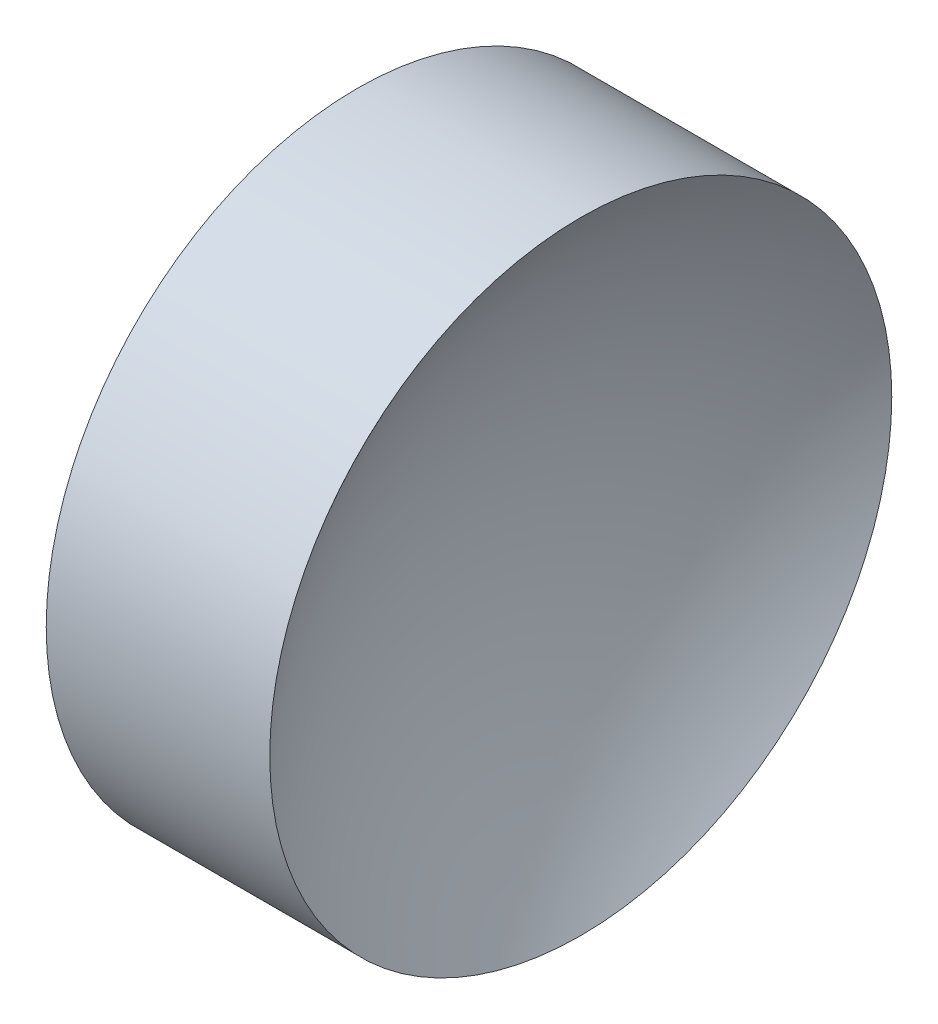
ISO-10303-21;
HEADER;
FILE_DESCRIPTION(('STEP AP214'),'2;1');
FILE_NAME('part.step','',(''),(''),'','','');
FILE_SCHEMA(('AUTOMOTIVE_DESIGN { 1 0 10303 214 1 1 1 1 }'));
ENDSEC;
DATA;
#1=APPLICATION_CONTEXT('core data for automotive mechanical design processes');
#2=APPLICATION_PROTOCOL_DEFINITION('international standard','automotive_design',2000,#1);
#3=PRODUCT_CONTEXT('',#1,'mechanical');
#4=PRODUCT('Part','Part','',(#3));
#5=PRODUCT_RELATED_PRODUCT_CATEGORY('part','',(#4));
#6=PRODUCT_DEFINITION_FORMATION('','',#4);
#7=PRODUCT_DEFINITION_CONTEXT('part definition',#1,'design');
#8=PRODUCT_DEFINITION('design','',#6,#7);
#9=PRODUCT_DEFINITION_SHAPE('','',#8);
#10=(LENGTH_UNIT() NAMED_UNIT(*) SI_UNIT(.MILLI.,.METRE.));
#11=(NAMED_UNIT(*) PLANE_ANGLE_UNIT() SI_UNIT($,.RADIAN.));
#12=(NAMED_UNIT(*) SI_UNIT($,.STERADIAN.) SOLID_ANGLE_UNIT());
#13=UNCERTAINTY_MEASURE_WITH_UNIT(LENGTH_MEASURE(1.E-05),#10,'distance_accuracy_value','');
#14=(GEOMETRIC_REPRESENTATION_CONTEXT(3) GLOBAL_UNCERTAINTY_ASSIGNED_CONTEXT((#13)) GLOBAL_UNIT_ASSIGNED_CONTEXT((#10,
#11,#12)) REPRESENTATION_CONTEXT('',''));
#15=CARTESIAN_POINT('',(0.,0.,0.));
#16=DIRECTION('',(0.,0.,1.));
#17=DIRECTION('',(1.,0.,0.));
#18=AXIS2_PLACEMENT_3D('',#15,#16,#17);
#19=CARTESIAN_POINT('',(61.0447110158185,28.4775956346375,0.));
#20=DIRECTION('',(-1.,0.,0.));
#21=DIRECTION('',(0.,-1.,0.));
#22=AXIS2_PLACEMENT_3D('',#19,#20,#21);
#23=SPHERICAL_SURFACE('',#22,10.8);
#24=CARTESIAN_POINT('',(52.3087222337744,28.4775956346375,0.));
#25=DIRECTION('',(-1.,0.,0.));
#26=DIRECTION('',(0.,0.,1.));
#27=AXIS2_PLACEMENT_3D('',#24,#25,#26);
#28=CIRCLE('',#27,6.34999999999999);
#29=CARTESIAN_POINT('',(52.3087222337744,28.4775956346375,6.34999999999999));
#30=VERTEX_POINT('',#29);
#31=EDGE_CURVE('E10',#30,#30,#28,.T.);
#32=ORIENTED_EDGE('',*,*,#31,.F.);
#33=EDGE_LOOP('',(#32));
#34=FACE_BOUND('',#33,.T.);
#35=ADVANCED_FACE('F35',(#34),#23,.F.);
#36=CARTESIAN_POINT('',(44.7820919030242,28.4775956346375,0.));
#37=DIRECTION('',(-1.,0.,0.));
#38=DIRECTION('',(0.,0.,1.));
#39=AXIS2_PLACEMENT_3D('',#36,#37,#38);
#40=CYLINDRICAL_SURFACE('',#39,6.34999999999999);
#41=CARTESIAN_POINT('',(47.7447110158185,28.4775956346375,0.));
#42=DIRECTION('',(-1.,0.,0.));
#43=DIRECTION('',(0.,0.,1.));
#44=AXIS2_PLACEMENT_3D('',#41,#42,#43);
#45=CIRCLE('',#44,6.35);
#46=CARTESIAN_POINT('',(47.7447110158185,28.4775956346375,6.35));
#47=VERTEX_POINT('',#46);
#48=EDGE_CURVE('E41',#47,#47,#45,.T.);
#49=ORIENTED_EDGE('',*,*,#48,.F.);
#50=EDGE_LOOP('',(#49));
#51=FACE_BOUND('',#50,.T.);
#52=ORIENTED_EDGE('',*,*,#31,.T.);
#53=EDGE_LOOP('',(#52));
#54=FACE_BOUND('',#53,.T.);
#55=ADVANCED_FACE('F49',(#51,#54),#40,.T.);
#56=CARTESIAN_POINT('',(47.7447110158185,28.4775956346375,0.));
#57=DIRECTION('',(1.,0.,0.));
#58=DIRECTION('',(0.,0.,-1.));
#59=AXIS2_PLACEMENT_3D('',#56,#57,#58);
#60=PLANE('',#59);
#61=ORIENTED_EDGE('',*,*,#48,.T.);
#62=EDGE_LOOP('',(#61));
#63=FACE_BOUND('',#62,.T.);
#64=ADVANCED_FACE('F47',(#63),#60,.F.);
#65=CLOSED_SHELL('',(#35,#55,#64));
#66=MANIFOLD_SOLID_BREP('B2',#65);
#67=ADVANCED_BREP_SHAPE_REPRESENTATION('',(#18,#66),#14);
#68=SHAPE_DEFINITION_REPRESENTATION(#9,#67);
ENDSEC;
END-ISO-10303-21;
